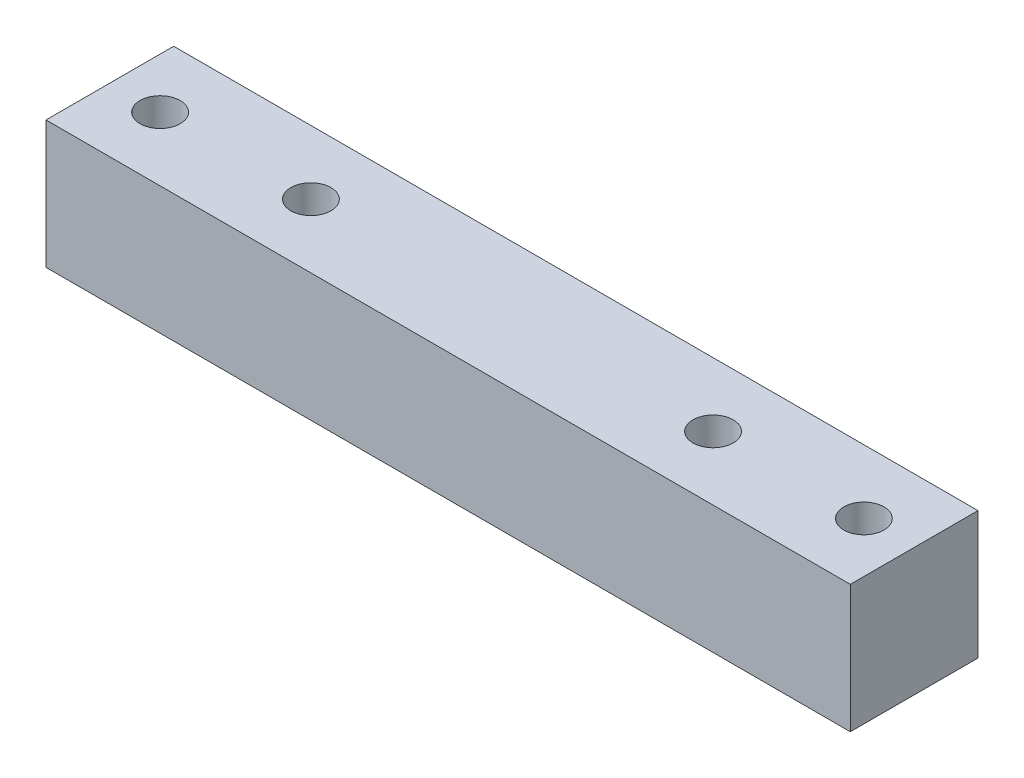
ISO-10303-21;
HEADER;
FILE_DESCRIPTION(('STEP AP214'),'2;1');
FILE_NAME('part.step','',(''),(''),'','','');
FILE_SCHEMA(('AUTOMOTIVE_DESIGN { 1 0 10303 214 1 1 1 1 }'));
ENDSEC;
DATA;
#1=APPLICATION_CONTEXT('core data for automotive mechanical design processes');
#2=APPLICATION_PROTOCOL_DEFINITION('international standard','automotive_design',2000,#1);
#3=PRODUCT_CONTEXT('',#1,'mechanical');
#4=PRODUCT('Part','Part','',(#3));
#5=PRODUCT_RELATED_PRODUCT_CATEGORY('part','',(#4));
#6=PRODUCT_DEFINITION_FORMATION('','',#4);
#7=PRODUCT_DEFINITION_CONTEXT('part definition',#1,'design');
#8=PRODUCT_DEFINITION('design','',#6,#7);
#9=PRODUCT_DEFINITION_SHAPE('','',#8);
#10=(LENGTH_UNIT() NAMED_UNIT(*) SI_UNIT(.MILLI.,.METRE.));
#11=(NAMED_UNIT(*) PLANE_ANGLE_UNIT() SI_UNIT($,.RADIAN.));
#12=(NAMED_UNIT(*) SI_UNIT($,.STERADIAN.) SOLID_ANGLE_UNIT());
#13=UNCERTAINTY_MEASURE_WITH_UNIT(LENGTH_MEASURE(1.E-05),#10,'distance_accuracy_value','');
#14=(GEOMETRIC_REPRESENTATION_CONTEXT(3) GLOBAL_UNCERTAINTY_ASSIGNED_CONTEXT((#13)) GLOBAL_UNIT_ASSIGNED_CONTEXT((#10,
#11,#12)) REPRESENTATION_CONTEXT('',''));
#15=CARTESIAN_POINT('',(0.,0.,0.));
#16=DIRECTION('',(0.,0.,1.));
#17=DIRECTION('',(1.,0.,0.));
#18=AXIS2_PLACEMENT_3D('',#15,#16,#17);
#19=CARTESIAN_POINT('',(0.,12.7,0.));
#20=DIRECTION('',(0.,1.,0.));
#21=DIRECTION('',(0.,0.,1.));
#22=AXIS2_PLACEMENT_3D('',#19,#20,#21);
#23=PLANE('',#22);
#24=CARTESIAN_POINT('',(20.,12.7,0.));
#25=DIRECTION('',(0.,1.,0.));
#26=DIRECTION('',(0.,0.,1.));
#27=AXIS2_PLACEMENT_3D('',#24,#25,#26);
#28=CIRCLE('',#27,2.);
#29=CARTESIAN_POINT('',(20.,12.7,2.));
#30=VERTEX_POINT('',#29);
#31=EDGE_CURVE('E131',#30,#30,#28,.T.);
#32=ORIENTED_EDGE('',*,*,#31,.F.);
#33=EDGE_LOOP('',(#32));
#34=FACE_BOUND('',#33,.T.);
#35=CARTESIAN_POINT('',(-35.,12.7,0.));
#36=DIRECTION('',(0.,1.,0.));
#37=DIRECTION('',(0.,0.,1.));
#38=AXIS2_PLACEMENT_3D('',#35,#36,#37);
#39=CIRCLE('',#38,2.);
#40=CARTESIAN_POINT('',(-35.,12.7,2.));
#41=VERTEX_POINT('',#40);
#42=EDGE_CURVE('E110',#41,#41,#39,.T.);
#43=ORIENTED_EDGE('',*,*,#42,.F.);
#44=EDGE_LOOP('',(#43));
#45=FACE_BOUND('',#44,.T.);
#46=DIRECTION('',(0.,0.,1.));
#47=VECTOR('',#46,1.);
#48=CARTESIAN_POINT('',(-40.,12.7,6.35));
#49=LINE('',#48,#47);
#50=CARTESIAN_POINT('',(-40.,12.7,-6.35));
#51=VERTEX_POINT('',#50);
#52=CARTESIAN_POINT('',(-40.,12.7,6.35));
#53=VERTEX_POINT('',#52);
#54=EDGE_CURVE('E95',#51,#53,#49,.T.);
#55=ORIENTED_EDGE('',*,*,#54,.T.);
#56=DIRECTION('',(1.,0.,0.));
#57=VECTOR('',#56,1.);
#58=CARTESIAN_POINT('',(40.,12.7,6.34999999999999));
#59=LINE('',#58,#57);
#60=CARTESIAN_POINT('',(40.,12.7,6.34999999999999));
#61=VERTEX_POINT('',#60);
#62=EDGE_CURVE('E90',#53,#61,#59,.T.);
#63=ORIENTED_EDGE('',*,*,#62,.T.);
#64=DIRECTION('',(0.,0.,-1.));
#65=VECTOR('',#64,1.);
#66=CARTESIAN_POINT('',(40.,12.7,6.34999999999999));
#67=LINE('',#66,#65);
#68=CARTESIAN_POINT('',(40.,12.7,-6.35000000000001));
#69=VERTEX_POINT('',#68);
#70=EDGE_CURVE('E93',#61,#69,#67,.T.);
#71=ORIENTED_EDGE('',*,*,#70,.T.);
#72=DIRECTION('',(-1.,0.,0.));
#73=VECTOR('',#72,1.);
#74=CARTESIAN_POINT('',(40.,12.7,-6.35000000000001));
#75=LINE('',#74,#73);
#76=EDGE_CURVE('E60',#69,#51,#75,.T.);
#77=ORIENTED_EDGE('',*,*,#76,.T.);
#78=EDGE_LOOP('',(#55,#63,#71,#77));
#79=FACE_BOUND('',#78,.T.);
#80=CARTESIAN_POINT('',(35.,12.7,0.));
#81=DIRECTION('',(0.,1.,0.));
#82=DIRECTION('',(0.,0.,1.));
#83=AXIS2_PLACEMENT_3D('',#80,#81,#82);
#84=CIRCLE('',#83,2.);
#85=CARTESIAN_POINT('',(35.,12.7,2.));
#86=VERTEX_POINT('',#85);
#87=EDGE_CURVE('E125',#86,#86,#84,.T.);
#88=ORIENTED_EDGE('',*,*,#87,.F.);
#89=EDGE_LOOP('',(#88));
#90=FACE_BOUND('',#89,.T.);
#91=CARTESIAN_POINT('',(-20.,12.7,0.));
#92=DIRECTION('',(0.,1.,0.));
#93=DIRECTION('',(0.,0.,1.));
#94=AXIS2_PLACEMENT_3D('',#91,#92,#93);
#95=CIRCLE('',#94,2.);
#96=CARTESIAN_POINT('',(-20.,12.7,2.));
#97=VERTEX_POINT('',#96);
#98=EDGE_CURVE('E137',#97,#97,#95,.T.);
#99=ORIENTED_EDGE('',*,*,#98,.F.);
#100=EDGE_LOOP('',(#99));
#101=FACE_BOUND('',#100,.T.);
#102=ADVANCED_FACE('F43',(#34,#45,#79,#90,#101),#23,.T.);
#103=CARTESIAN_POINT('',(0.,0.,0.));
#104=DIRECTION('',(0.,1.,0.));
#105=DIRECTION('',(0.,0.,1.));
#106=AXIS2_PLACEMENT_3D('',#103,#104,#105);
#107=PLANE('',#106);
#108=DIRECTION('',(0.,0.,1.));
#109=VECTOR('',#108,1.);
#110=CARTESIAN_POINT('',(-40.,0.,6.35));
#111=LINE('',#110,#109);
#112=CARTESIAN_POINT('',(-40.,0.,-6.35));
#113=VERTEX_POINT('',#112);
#114=CARTESIAN_POINT('',(-40.,0.,6.35));
#115=VERTEX_POINT('',#114);
#116=EDGE_CURVE('E107',#113,#115,#111,.T.);
#117=ORIENTED_EDGE('',*,*,#116,.F.);
#118=DIRECTION('',(-1.,0.,0.));
#119=VECTOR('',#118,1.);
#120=CARTESIAN_POINT('',(40.,0.,-6.35000000000001));
#121=LINE('',#120,#119);
#122=CARTESIAN_POINT('',(40.,0.,-6.35000000000001));
#123=VERTEX_POINT('',#122);
#124=EDGE_CURVE('E83',#123,#113,#121,.T.);
#125=ORIENTED_EDGE('',*,*,#124,.F.);
#126=DIRECTION('',(0.,0.,-1.));
#127=VECTOR('',#126,1.);
#128=CARTESIAN_POINT('',(40.,0.,6.34999999999999));
#129=LINE('',#128,#127);
#130=CARTESIAN_POINT('',(40.,0.,6.34999999999999));
#131=VERTEX_POINT('',#130);
#132=EDGE_CURVE('E77',#131,#123,#129,.T.);
#133=ORIENTED_EDGE('',*,*,#132,.F.);
#134=DIRECTION('',(1.,0.,0.));
#135=VECTOR('',#134,1.);
#136=CARTESIAN_POINT('',(40.,0.,6.34999999999999));
#137=LINE('',#136,#135);
#138=EDGE_CURVE('E99',#115,#131,#137,.T.);
#139=ORIENTED_EDGE('',*,*,#138,.F.);
#140=EDGE_LOOP('',(#117,#125,#133,#139));
#141=FACE_BOUND('',#140,.T.);
#142=CARTESIAN_POINT('',(-35.,0.,0.));
#143=DIRECTION('',(0.,1.,0.));
#144=DIRECTION('',(0.,0.,1.));
#145=AXIS2_PLACEMENT_3D('',#142,#143,#144);
#146=CIRCLE('',#145,2.);
#147=CARTESIAN_POINT('',(-35.,0.,2.));
#148=VERTEX_POINT('',#147);
#149=EDGE_CURVE('E122',#148,#148,#146,.T.);
#150=ORIENTED_EDGE('',*,*,#149,.T.);
#151=EDGE_LOOP('',(#150));
#152=FACE_BOUND('',#151,.T.);
#153=CARTESIAN_POINT('',(35.,0.,0.));
#154=DIRECTION('',(0.,1.,0.));
#155=DIRECTION('',(0.,0.,1.));
#156=AXIS2_PLACEMENT_3D('',#153,#154,#155);
#157=CIRCLE('',#156,2.);
#158=CARTESIAN_POINT('',(35.,0.,2.));
#159=VERTEX_POINT('',#158);
#160=EDGE_CURVE('E128',#159,#159,#157,.T.);
#161=ORIENTED_EDGE('',*,*,#160,.T.);
#162=EDGE_LOOP('',(#161));
#163=FACE_BOUND('',#162,.T.);
#164=CARTESIAN_POINT('',(20.,0.,0.));
#165=DIRECTION('',(0.,1.,0.));
#166=DIRECTION('',(0.,0.,1.));
#167=AXIS2_PLACEMENT_3D('',#164,#165,#166);
#168=CIRCLE('',#167,2.);
#169=CARTESIAN_POINT('',(20.,0.,2.));
#170=VERTEX_POINT('',#169);
#171=EDGE_CURVE('E134',#170,#170,#168,.T.);
#172=ORIENTED_EDGE('',*,*,#171,.T.);
#173=EDGE_LOOP('',(#172));
#174=FACE_BOUND('',#173,.T.);
#175=CARTESIAN_POINT('',(-20.,0.,0.));
#176=DIRECTION('',(0.,1.,0.));
#177=DIRECTION('',(0.,0.,1.));
#178=AXIS2_PLACEMENT_3D('',#175,#176,#177);
#179=CIRCLE('',#178,2.);
#180=CARTESIAN_POINT('',(-20.,0.,2.));
#181=VERTEX_POINT('',#180);
#182=EDGE_CURVE('E140',#181,#181,#179,.T.);
#183=ORIENTED_EDGE('',*,*,#182,.T.);
#184=EDGE_LOOP('',(#183));
#185=FACE_BOUND('',#184,.T.);
#186=ADVANCED_FACE('F118',(#141,#152,#163,#174,#185),#107,.F.);
#187=CARTESIAN_POINT('',(-40.,12.7,6.35));
#188=DIRECTION('',(1.,0.,0.));
#189=DIRECTION('',(0.,0.,-1.));
#190=AXIS2_PLACEMENT_3D('',#187,#188,#189);
#191=PLANE('',#190);
#192=ORIENTED_EDGE('',*,*,#116,.T.);
#193=DIRECTION('',(0.,-1.,0.));
#194=VECTOR('',#193,1.);
#195=CARTESIAN_POINT('',(-40.,12.7,6.35));
#196=LINE('',#195,#194);
#197=EDGE_CURVE('E11',#53,#115,#196,.T.);
#198=ORIENTED_EDGE('',*,*,#197,.F.);
#199=ORIENTED_EDGE('',*,*,#54,.F.);
#200=DIRECTION('',(0.,-1.,0.));
#201=VECTOR('',#200,1.);
#202=CARTESIAN_POINT('',(-40.,12.7,-6.35));
#203=LINE('',#202,#201);
#204=EDGE_CURVE('E103',#51,#113,#203,.T.);
#205=ORIENTED_EDGE('',*,*,#204,.T.);
#206=EDGE_LOOP('',(#192,#198,#199,#205));
#207=FACE_BOUND('',#206,.T.);
#208=ADVANCED_FACE('F45',(#207),#191,.F.);
#209=CARTESIAN_POINT('',(40.,12.7,6.34999999999999));
#210=DIRECTION('',(0.,0.,-1.));
#211=DIRECTION('',(-1.,0.,0.));
#212=AXIS2_PLACEMENT_3D('',#209,#210,#211);
#213=PLANE('',#212);
#214=ORIENTED_EDGE('',*,*,#138,.T.);
#215=DIRECTION('',(0.,-1.,0.));
#216=VECTOR('',#215,1.);
#217=CARTESIAN_POINT('',(40.,12.7,6.34999999999999));
#218=LINE('',#217,#216);
#219=EDGE_CURVE('E52',#61,#131,#218,.T.);
#220=ORIENTED_EDGE('',*,*,#219,.F.);
#221=ORIENTED_EDGE('',*,*,#62,.F.);
#222=ORIENTED_EDGE('',*,*,#197,.T.);
#223=EDGE_LOOP('',(#214,#220,#221,#222));
#224=FACE_BOUND('',#223,.T.);
#225=ADVANCED_FACE('F98',(#224),#213,.F.);
#226=CARTESIAN_POINT('',(40.,12.7,6.34999999999999));
#227=DIRECTION('',(-1.,0.,0.));
#228=DIRECTION('',(0.,0.,1.));
#229=AXIS2_PLACEMENT_3D('',#226,#227,#228);
#230=PLANE('',#229);
#231=ORIENTED_EDGE('',*,*,#132,.T.);
#232=DIRECTION('',(0.,-1.,0.));
#233=VECTOR('',#232,1.);
#234=CARTESIAN_POINT('',(40.,12.7,-6.35000000000001));
#235=LINE('',#234,#233);
#236=EDGE_CURVE('E100',#69,#123,#235,.T.);
#237=ORIENTED_EDGE('',*,*,#236,.F.);
#238=ORIENTED_EDGE('',*,*,#70,.F.);
#239=ORIENTED_EDGE('',*,*,#219,.T.);
#240=EDGE_LOOP('',(#231,#237,#238,#239));
#241=FACE_BOUND('',#240,.T.);
#242=ADVANCED_FACE('F101',(#241),#230,.F.);
#243=CARTESIAN_POINT('',(40.,12.7,-6.35000000000001));
#244=DIRECTION('',(0.,0.,1.));
#245=DIRECTION('',(1.,0.,0.));
#246=AXIS2_PLACEMENT_3D('',#243,#244,#245);
#247=PLANE('',#246);
#248=ORIENTED_EDGE('',*,*,#124,.T.);
#249=ORIENTED_EDGE('',*,*,#204,.F.);
#250=ORIENTED_EDGE('',*,*,#76,.F.);
#251=ORIENTED_EDGE('',*,*,#236,.T.);
#252=EDGE_LOOP('',(#248,#249,#250,#251));
#253=FACE_BOUND('',#252,.T.);
#254=ADVANCED_FACE('F115',(#253),#247,.F.);
#255=CARTESIAN_POINT('',(-35.,12.7,0.));
#256=DIRECTION('',(0.,-1.,0.));
#257=DIRECTION('',(0.,0.,-1.));
#258=AXIS2_PLACEMENT_3D('',#255,#256,#257);
#259=CYLINDRICAL_SURFACE('',#258,2.);
#260=ORIENTED_EDGE('',*,*,#42,.T.);
#261=EDGE_LOOP('',(#260));
#262=FACE_BOUND('',#261,.T.);
#263=ORIENTED_EDGE('',*,*,#149,.F.);
#264=EDGE_LOOP('',(#263));
#265=FACE_BOUND('',#264,.T.);
#266=ADVANCED_FACE('F159',(#262,#265),#259,.F.);
#267=CARTESIAN_POINT('',(35.,12.7,0.));
#268=DIRECTION('',(0.,-1.,0.));
#269=DIRECTION('',(0.,0.,-1.));
#270=AXIS2_PLACEMENT_3D('',#267,#268,#269);
#271=CYLINDRICAL_SURFACE('',#270,2.);
#272=ORIENTED_EDGE('',*,*,#87,.T.);
#273=EDGE_LOOP('',(#272));
#274=FACE_BOUND('',#273,.T.);
#275=ORIENTED_EDGE('',*,*,#160,.F.);
#276=EDGE_LOOP('',(#275));
#277=FACE_BOUND('',#276,.T.);
#278=ADVANCED_FACE('F204',(#274,#277),#271,.F.);
#279=CARTESIAN_POINT('',(20.,12.7,0.));
#280=DIRECTION('',(0.,-1.,0.));
#281=DIRECTION('',(0.,0.,-1.));
#282=AXIS2_PLACEMENT_3D('',#279,#280,#281);
#283=CYLINDRICAL_SURFACE('',#282,2.);
#284=ORIENTED_EDGE('',*,*,#31,.T.);
#285=EDGE_LOOP('',(#284));
#286=FACE_BOUND('',#285,.T.);
#287=ORIENTED_EDGE('',*,*,#171,.F.);
#288=EDGE_LOOP('',(#287));
#289=FACE_BOUND('',#288,.T.);
#290=ADVANCED_FACE('F212',(#286,#289),#283,.F.);
#291=CARTESIAN_POINT('',(-20.,12.7,0.));
#292=DIRECTION('',(0.,-1.,0.));
#293=DIRECTION('',(0.,0.,-1.));
#294=AXIS2_PLACEMENT_3D('',#291,#292,#293);
#295=CYLINDRICAL_SURFACE('',#294,2.);
#296=ORIENTED_EDGE('',*,*,#98,.T.);
#297=EDGE_LOOP('',(#296));
#298=FACE_BOUND('',#297,.T.);
#299=ORIENTED_EDGE('',*,*,#182,.F.);
#300=EDGE_LOOP('',(#299));
#301=FACE_BOUND('',#300,.T.);
#302=ADVANCED_FACE('F146',(#298,#301),#295,.F.);
#303=CLOSED_SHELL('',(#102,#186,#208,#225,#242,#254,#266,#278,#290,#302));
#304=MANIFOLD_SOLID_BREP('B2',#303);
#305=ADVANCED_BREP_SHAPE_REPRESENTATION('',(#18,#304),#14);
#306=SHAPE_DEFINITION_REPRESENTATION(#9,#305);
ENDSEC;
END-ISO-10303-21;
